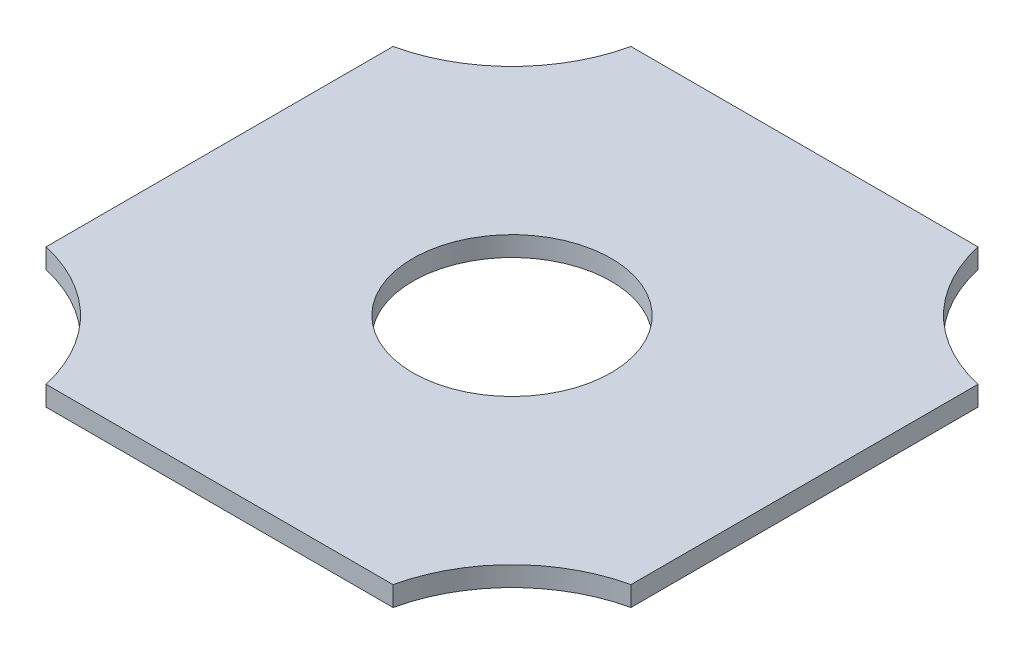
ISO-10303-21;
HEADER;
FILE_DESCRIPTION(('STEP AP214'),'2;1');
FILE_NAME('part.step','',(''),(''),'','','');
FILE_SCHEMA(('AUTOMOTIVE_DESIGN { 1 0 10303 214 1 1 1 1 }'));
ENDSEC;
DATA;
#1=APPLICATION_CONTEXT('core data for automotive mechanical design processes');
#2=APPLICATION_PROTOCOL_DEFINITION('international standard','automotive_design',2000,#1);
#3=PRODUCT_CONTEXT('',#1,'mechanical');
#4=PRODUCT('Part','Part','',(#3));
#5=PRODUCT_RELATED_PRODUCT_CATEGORY('part','',(#4));
#6=PRODUCT_DEFINITION_FORMATION('','',#4);
#7=PRODUCT_DEFINITION_CONTEXT('part definition',#1,'design');
#8=PRODUCT_DEFINITION('design','',#6,#7);
#9=PRODUCT_DEFINITION_SHAPE('','',#8);
#10=(LENGTH_UNIT() NAMED_UNIT(*) SI_UNIT(.MILLI.,.METRE.));
#11=(NAMED_UNIT(*) PLANE_ANGLE_UNIT() SI_UNIT($,.RADIAN.));
#12=(NAMED_UNIT(*) SI_UNIT($,.STERADIAN.) SOLID_ANGLE_UNIT());
#13=UNCERTAINTY_MEASURE_WITH_UNIT(LENGTH_MEASURE(1.E-05),#10,'distance_accuracy_value','');
#14=(GEOMETRIC_REPRESENTATION_CONTEXT(3) GLOBAL_UNCERTAINTY_ASSIGNED_CONTEXT((#13)) GLOBAL_UNIT_ASSIGNED_CONTEXT((#10,
#11,#12)) REPRESENTATION_CONTEXT('',''));
#15=CARTESIAN_POINT('',(0.,0.,0.));
#16=DIRECTION('',(0.,0.,1.));
#17=DIRECTION('',(1.,0.,0.));
#18=AXIS2_PLACEMENT_3D('',#15,#16,#17);
#19=CARTESIAN_POINT('',(-32.2270175622713,2.,-34.0017247818068));
#20=DIRECTION('',(0.,-1.,0.));
#21=DIRECTION('',(0.,0.,-1.));
#22=AXIS2_PLACEMENT_3D('',#19,#20,#21);
#23=CYLINDRICAL_SURFACE('',#22,15.8501875594606);
#24=CARTESIAN_POINT('',(-32.2270175622713,0.,-34.0017247818068));
#25=DIRECTION('',(0.,-1.,0.));
#26=DIRECTION('',(0.,0.,1.));
#27=AXIS2_PLACEMENT_3D('',#24,#25,#26);
#28=CIRCLE('',#27,15.8501875594606);
#29=CARTESIAN_POINT('',(-16.7605386585269,0.,-30.5352458780619));
#30=VERTEX_POINT('',#29);
#31=CARTESIAN_POINT('',(-28.760538658527,0.,-18.5352458780623));
#32=VERTEX_POINT('',#31);
#33=EDGE_CURVE('E137',#30,#32,#28,.T.);
#34=ORIENTED_EDGE('',*,*,#33,.T.);
#35=DIRECTION('',(0.,-1.,0.));
#36=VECTOR('',#35,1.);
#37=CARTESIAN_POINT('',(-28.760538658527,2.,-18.5352458780623));
#38=LINE('',#37,#36);
#39=CARTESIAN_POINT('',(-28.760538658527,2.,-18.5352458780623));
#40=VERTEX_POINT('',#39);
#41=EDGE_CURVE('E11',#40,#32,#38,.T.);
#42=ORIENTED_EDGE('',*,*,#41,.F.);
#43=CARTESIAN_POINT('',(-32.2270175622713,2.,-34.0017247818068));
#44=DIRECTION('',(0.,-1.,0.));
#45=DIRECTION('',(0.,0.,1.));
#46=AXIS2_PLACEMENT_3D('',#43,#44,#45);
#47=CIRCLE('',#46,15.8501875594606);
#48=CARTESIAN_POINT('',(-16.7605386585269,2.,-30.5352458780619));
#49=VERTEX_POINT('',#48);
#50=EDGE_CURVE('E151',#49,#40,#47,.T.);
#51=ORIENTED_EDGE('',*,*,#50,.F.);
#52=DIRECTION('',(0.,-1.,0.));
#53=VECTOR('',#52,1.);
#54=CARTESIAN_POINT('',(-16.7605386585269,2.,-30.5352458780619));
#55=LINE('',#54,#53);
#56=EDGE_CURVE('E133',#49,#30,#55,.T.);
#57=ORIENTED_EDGE('',*,*,#56,.T.);
#58=EDGE_LOOP('',(#34,#42,#51,#57));
#59=FACE_BOUND('',#58,.T.);
#60=ADVANCED_FACE('F40',(#59),#23,.F.);
#61=CARTESIAN_POINT('',(-28.760538658527,2.,-18.5352458780623));
#62=DIRECTION('',(1.,0.,0.));
#63=DIRECTION('',(0.,0.,-1.));
#64=AXIS2_PLACEMENT_3D('',#61,#62,#63);
#65=PLANE('',#64);
#66=DIRECTION('',(0.,0.,1.));
#67=VECTOR('',#66,1.);
#68=CARTESIAN_POINT('',(-28.760538658527,0.,-18.5352458780623));
#69=LINE('',#68,#67);
#70=CARTESIAN_POINT('',(-28.7605386585271,0.,16.4647541219377));
#71=VERTEX_POINT('',#70);
#72=EDGE_CURVE('E140',#32,#71,#69,.T.);
#73=ORIENTED_EDGE('',*,*,#72,.T.);
#74=DIRECTION('',(0.,-1.,0.));
#75=VECTOR('',#74,1.);
#76=CARTESIAN_POINT('',(-28.7605386585271,2.,16.4647541219377));
#77=LINE('',#76,#75);
#78=CARTESIAN_POINT('',(-28.7605386585271,2.,16.4647541219377));
#79=VERTEX_POINT('',#78);
#80=EDGE_CURVE('E49',#79,#71,#77,.T.);
#81=ORIENTED_EDGE('',*,*,#80,.F.);
#82=DIRECTION('',(0.,0.,1.));
#83=VECTOR('',#82,1.);
#84=CARTESIAN_POINT('',(-28.760538658527,2.,-18.5352458780623));
#85=LINE('',#84,#83);
#86=EDGE_CURVE('E100',#40,#79,#85,.T.);
#87=ORIENTED_EDGE('',*,*,#86,.F.);
#88=ORIENTED_EDGE('',*,*,#41,.T.);
#89=EDGE_LOOP('',(#73,#81,#87,#88));
#90=FACE_BOUND('',#89,.T.);
#91=ADVANCED_FACE('F202',(#90),#65,.F.);
#92=CARTESIAN_POINT('',(-32.2270175622719,2.,31.9312330256822));
#93=DIRECTION('',(0.,-1.,0.));
#94=DIRECTION('',(0.,0.,-1.));
#95=AXIS2_PLACEMENT_3D('',#92,#93,#94);
#96=CYLINDRICAL_SURFACE('',#95,15.8501875594607);
#97=CARTESIAN_POINT('',(-32.2270175622719,0.,31.9312330256822));
#98=DIRECTION('',(0.,-1.,0.));
#99=DIRECTION('',(0.,0.,1.));
#100=AXIS2_PLACEMENT_3D('',#97,#98,#99);
#101=CIRCLE('',#100,15.8501875594607);
#102=CARTESIAN_POINT('',(-16.7605386585272,0.,28.464754121938));
#103=VERTEX_POINT('',#102);
#104=EDGE_CURVE('E142',#71,#103,#101,.T.);
#105=ORIENTED_EDGE('',*,*,#104,.T.);
#106=DIRECTION('',(0.,-1.,0.));
#107=VECTOR('',#106,1.);
#108=CARTESIAN_POINT('',(-16.7605386585272,2.,28.464754121938));
#109=LINE('',#108,#107);
#110=CARTESIAN_POINT('',(-16.7605386585272,2.,28.464754121938));
#111=VERTEX_POINT('',#110);
#112=EDGE_CURVE('E158',#111,#103,#109,.T.);
#113=ORIENTED_EDGE('',*,*,#112,.F.);
#114=CARTESIAN_POINT('',(-32.2270175622719,2.,31.9312330256822));
#115=DIRECTION('',(0.,-1.,0.));
#116=DIRECTION('',(0.,0.,1.));
#117=AXIS2_PLACEMENT_3D('',#114,#115,#116);
#118=CIRCLE('',#117,15.8501875594607);
#119=EDGE_CURVE('E167',#79,#111,#118,.T.);
#120=ORIENTED_EDGE('',*,*,#119,.F.);
#121=ORIENTED_EDGE('',*,*,#80,.T.);
#122=EDGE_LOOP('',(#105,#113,#120,#121));
#123=FACE_BOUND('',#122,.T.);
#124=ADVANCED_FACE('F165',(#123),#96,.F.);
#125=CARTESIAN_POINT('',(-16.7605386585272,2.,28.464754121938));
#126=DIRECTION('',(0.,0.,-1.));
#127=DIRECTION('',(-1.,0.,0.));
#128=AXIS2_PLACEMENT_3D('',#125,#126,#127);
#129=PLANE('',#128);
#130=DIRECTION('',(1.,0.,0.));
#131=VECTOR('',#130,1.);
#132=CARTESIAN_POINT('',(-16.7605386585272,0.,28.464754121938));
#133=LINE('',#132,#131);
#134=CARTESIAN_POINT('',(18.2394613414727,0.,28.464754121938));
#135=VERTEX_POINT('',#134);
#136=EDGE_CURVE('E144',#103,#135,#133,.T.);
#137=ORIENTED_EDGE('',*,*,#136,.T.);
#138=DIRECTION('',(0.,-1.,0.));
#139=VECTOR('',#138,1.);
#140=CARTESIAN_POINT('',(18.2394613414727,2.,28.464754121938));
#141=LINE('',#140,#139);
#142=CARTESIAN_POINT('',(18.2394613414727,2.,28.464754121938));
#143=VERTEX_POINT('',#142);
#144=EDGE_CURVE('E155',#143,#135,#141,.T.);
#145=ORIENTED_EDGE('',*,*,#144,.F.);
#146=DIRECTION('',(1.,0.,0.));
#147=VECTOR('',#146,1.);
#148=CARTESIAN_POINT('',(-16.7605386585272,2.,28.464754121938));
#149=LINE('',#148,#147);
#150=EDGE_CURVE('E179',#111,#143,#149,.T.);
#151=ORIENTED_EDGE('',*,*,#150,.F.);
#152=ORIENTED_EDGE('',*,*,#112,.T.);
#153=EDGE_LOOP('',(#137,#145,#151,#152));
#154=FACE_BOUND('',#153,.T.);
#155=ADVANCED_FACE('F175',(#154),#129,.F.);
#156=CARTESIAN_POINT('',(33.7059402452171,2.,31.9312330256826));
#157=DIRECTION('',(0.,-1.,0.));
#158=DIRECTION('',(0.,0.,-1.));
#159=AXIS2_PLACEMENT_3D('',#156,#157,#158);
#160=CYLINDRICAL_SURFACE('',#159,15.8501875594606);
#161=CARTESIAN_POINT('',(33.7059402452171,0.,31.9312330256826));
#162=DIRECTION('',(0.,-1.,0.));
#163=DIRECTION('',(0.,0.,1.));
#164=AXIS2_PLACEMENT_3D('',#161,#162,#163);
#165=CIRCLE('',#164,15.8501875594606);
#166=CARTESIAN_POINT('',(30.2394613414728,0.,16.4647541219381));
#167=VERTEX_POINT('',#166);
#168=EDGE_CURVE('E146',#135,#167,#165,.T.);
#169=ORIENTED_EDGE('',*,*,#168,.T.);
#170=DIRECTION('',(0.,-1.,0.));
#171=VECTOR('',#170,1.);
#172=CARTESIAN_POINT('',(30.2394613414728,2.,16.4647541219381));
#173=LINE('',#172,#171);
#174=CARTESIAN_POINT('',(30.2394613414728,2.,16.4647541219381));
#175=VERTEX_POINT('',#174);
#176=EDGE_CURVE('E128',#175,#167,#173,.T.);
#177=ORIENTED_EDGE('',*,*,#176,.F.);
#178=CARTESIAN_POINT('',(33.7059402452171,2.,31.9312330256826));
#179=DIRECTION('',(0.,-1.,0.));
#180=DIRECTION('',(0.,0.,1.));
#181=AXIS2_PLACEMENT_3D('',#178,#179,#180);
#182=CIRCLE('',#181,15.8501875594606);
#183=EDGE_CURVE('E119',#143,#175,#182,.T.);
#184=ORIENTED_EDGE('',*,*,#183,.F.);
#185=ORIENTED_EDGE('',*,*,#144,.T.);
#186=EDGE_LOOP('',(#169,#177,#184,#185));
#187=FACE_BOUND('',#186,.T.);
#188=ADVANCED_FACE('F178',(#187),#160,.F.);
#189=CARTESIAN_POINT('',(30.2394613414728,2.,16.4647541219381));
#190=DIRECTION('',(-1.,0.,0.));
#191=DIRECTION('',(0.,0.,1.));
#192=AXIS2_PLACEMENT_3D('',#189,#190,#191);
#193=PLANE('',#192);
#194=DIRECTION('',(0.,0.,-1.));
#195=VECTOR('',#194,1.);
#196=CARTESIAN_POINT('',(30.2394613414728,0.,16.4647541219381));
#197=LINE('',#196,#195);
#198=CARTESIAN_POINT('',(30.2394613414728,0.,-18.5352458780619));
#199=VERTEX_POINT('',#198);
#200=EDGE_CURVE('E127',#167,#199,#197,.T.);
#201=ORIENTED_EDGE('',*,*,#200,.T.);
#202=DIRECTION('',(0.,-1.,0.));
#203=VECTOR('',#202,1.);
#204=CARTESIAN_POINT('',(30.2394613414728,2.,-18.5352458780619));
#205=LINE('',#204,#203);
#206=CARTESIAN_POINT('',(30.2394613414728,2.,-18.5352458780619));
#207=VERTEX_POINT('',#206);
#208=EDGE_CURVE('E124',#207,#199,#205,.T.);
#209=ORIENTED_EDGE('',*,*,#208,.F.);
#210=DIRECTION('',(0.,0.,-1.));
#211=VECTOR('',#210,1.);
#212=CARTESIAN_POINT('',(30.2394613414728,2.,16.4647541219381));
#213=LINE('',#212,#211);
#214=EDGE_CURVE('E113',#175,#207,#213,.T.);
#215=ORIENTED_EDGE('',*,*,#214,.F.);
#216=ORIENTED_EDGE('',*,*,#176,.T.);
#217=EDGE_LOOP('',(#201,#209,#215,#216));
#218=FACE_BOUND('',#217,.T.);
#219=ADVANCED_FACE('F125',(#218),#193,.F.);
#220=CARTESIAN_POINT('',(33.7059402452173,2.,-34.0017247818064));
#221=DIRECTION('',(0.,-1.,0.));
#222=DIRECTION('',(0.,0.,-1.));
#223=AXIS2_PLACEMENT_3D('',#220,#221,#222);
#224=CYLINDRICAL_SURFACE('',#223,15.8501875594607);
#225=CARTESIAN_POINT('',(33.7059402452173,0.,-34.0017247818064));
#226=DIRECTION('',(0.,-1.,0.));
#227=DIRECTION('',(0.,0.,1.));
#228=AXIS2_PLACEMENT_3D('',#225,#226,#227);
#229=CIRCLE('',#228,15.8501875594607);
#230=CARTESIAN_POINT('',(18.2394613414727,0.,-30.535245878062));
#231=VERTEX_POINT('',#230);
#232=EDGE_CURVE('E86',#199,#231,#229,.T.);
#233=ORIENTED_EDGE('',*,*,#232,.T.);
#234=DIRECTION('',(0.,-1.,0.));
#235=VECTOR('',#234,1.);
#236=CARTESIAN_POINT('',(18.2394613414727,2.,-30.535245878062));
#237=LINE('',#236,#235);
#238=CARTESIAN_POINT('',(18.2394613414727,2.,-30.535245878062));
#239=VERTEX_POINT('',#238);
#240=EDGE_CURVE('E129',#239,#231,#237,.T.);
#241=ORIENTED_EDGE('',*,*,#240,.F.);
#242=CARTESIAN_POINT('',(33.7059402452173,2.,-34.0017247818064));
#243=DIRECTION('',(0.,-1.,0.));
#244=DIRECTION('',(0.,0.,1.));
#245=AXIS2_PLACEMENT_3D('',#242,#243,#244);
#246=CIRCLE('',#245,15.8501875594607);
#247=EDGE_CURVE('E117',#207,#239,#246,.T.);
#248=ORIENTED_EDGE('',*,*,#247,.F.);
#249=ORIENTED_EDGE('',*,*,#208,.T.);
#250=EDGE_LOOP('',(#233,#241,#248,#249));
#251=FACE_BOUND('',#250,.T.);
#252=ADVANCED_FACE('F131',(#251),#224,.F.);
#253=CARTESIAN_POINT('',(18.2394613414727,2.,-30.535245878062));
#254=DIRECTION('',(0.,0.,1.));
#255=DIRECTION('',(1.,0.,0.));
#256=AXIS2_PLACEMENT_3D('',#253,#254,#255);
#257=PLANE('',#256);
#258=DIRECTION('',(-1.,0.,0.));
#259=VECTOR('',#258,1.);
#260=CARTESIAN_POINT('',(18.2394613414727,0.,-30.535245878062));
#261=LINE('',#260,#259);
#262=EDGE_CURVE('E92',#231,#30,#261,.T.);
#263=ORIENTED_EDGE('',*,*,#262,.T.);
#264=ORIENTED_EDGE('',*,*,#56,.F.);
#265=DIRECTION('',(-1.,0.,0.));
#266=VECTOR('',#265,1.);
#267=CARTESIAN_POINT('',(18.2394613414727,2.,-30.535245878062));
#268=LINE('',#267,#266);
#269=EDGE_CURVE('E57',#239,#49,#268,.T.);
#270=ORIENTED_EDGE('',*,*,#269,.F.);
#271=ORIENTED_EDGE('',*,*,#240,.T.);
#272=EDGE_LOOP('',(#263,#264,#270,#271));
#273=FACE_BOUND('',#272,.T.);
#274=ADVANCED_FACE('F209',(#273),#257,.F.);
#275=CARTESIAN_POINT('',(-32.2270175622713,2.,-34.0017247818068));
#276=DIRECTION('',(0.,1.,0.));
#277=DIRECTION('',(0.,0.,1.));
#278=AXIS2_PLACEMENT_3D('',#275,#276,#277);
#279=PLANE('',#278);
#280=CARTESIAN_POINT('',(0.73946134147285,2.,-1.03524587806197));
#281=DIRECTION('',(0.,1.,0.));
#282=DIRECTION('',(0.,0.,1.));
#283=AXIS2_PLACEMENT_3D('',#280,#281,#282);
#284=CIRCLE('',#283,10.);
#285=CARTESIAN_POINT('',(0.73946134147285,2.,8.96475412193803));
#286=VERTEX_POINT('',#285);
#287=EDGE_CURVE('E185',#286,#286,#284,.T.);
#288=ORIENTED_EDGE('',*,*,#287,.F.);
#289=EDGE_LOOP('',(#288));
#290=FACE_BOUND('',#289,.T.);
#291=ORIENTED_EDGE('',*,*,#50,.T.);
#292=ORIENTED_EDGE('',*,*,#86,.T.);
#293=ORIENTED_EDGE('',*,*,#119,.T.);
#294=ORIENTED_EDGE('',*,*,#150,.T.);
#295=ORIENTED_EDGE('',*,*,#183,.T.);
#296=ORIENTED_EDGE('',*,*,#214,.T.);
#297=ORIENTED_EDGE('',*,*,#247,.T.);
#298=ORIENTED_EDGE('',*,*,#269,.T.);
#299=EDGE_LOOP('',(#291,#292,#293,#294,#295,#296,#297,#298));
#300=FACE_BOUND('',#299,.T.);
#301=ADVANCED_FACE('F115',(#290,#300),#279,.T.);
#302=CARTESIAN_POINT('',(-32.2270175622713,0.,-34.0017247818068));
#303=DIRECTION('',(0.,1.,0.));
#304=DIRECTION('',(0.,0.,1.));
#305=AXIS2_PLACEMENT_3D('',#302,#303,#304);
#306=PLANE('',#305);
#307=CARTESIAN_POINT('',(0.73946134147285,0.,-1.03524587806197));
#308=DIRECTION('',(0.,1.,0.));
#309=DIRECTION('',(0.,0.,1.));
#310=AXIS2_PLACEMENT_3D('',#307,#308,#309);
#311=CIRCLE('',#310,10.);
#312=CARTESIAN_POINT('',(0.73946134147285,0.,8.96475412193803));
#313=VERTEX_POINT('',#312);
#314=EDGE_CURVE('E43',#313,#313,#311,.T.);
#315=ORIENTED_EDGE('',*,*,#314,.T.);
#316=EDGE_LOOP('',(#315));
#317=FACE_BOUND('',#316,.T.);
#318=ORIENTED_EDGE('',*,*,#33,.F.);
#319=ORIENTED_EDGE('',*,*,#262,.F.);
#320=ORIENTED_EDGE('',*,*,#232,.F.);
#321=ORIENTED_EDGE('',*,*,#200,.F.);
#322=ORIENTED_EDGE('',*,*,#168,.F.);
#323=ORIENTED_EDGE('',*,*,#136,.F.);
#324=ORIENTED_EDGE('',*,*,#104,.F.);
#325=ORIENTED_EDGE('',*,*,#72,.F.);
#326=EDGE_LOOP('',(#318,#319,#320,#321,#322,#323,#324,#325));
#327=FACE_BOUND('',#326,.T.);
#328=ADVANCED_FACE('F171',(#317,#327),#306,.F.);
#329=CARTESIAN_POINT('',(0.73946134147285,-1.,-1.03524587806197));
#330=DIRECTION('',(0.,1.,0.));
#331=DIRECTION('',(0.,0.,1.));
#332=AXIS2_PLACEMENT_3D('',#329,#330,#331);
#333=CYLINDRICAL_SURFACE('',#332,10.);
#334=ORIENTED_EDGE('',*,*,#287,.T.);
#335=EDGE_LOOP('',(#334));
#336=FACE_BOUND('',#335,.T.);
#337=ORIENTED_EDGE('',*,*,#314,.F.);
#338=EDGE_LOOP('',(#337));
#339=FACE_BOUND('',#338,.T.);
#340=ADVANCED_FACE('F193',(#336,#339),#333,.F.);
#341=CLOSED_SHELL('',(#60,#91,#124,#155,#188,#219,#252,#274,#301,#328,#340));
#342=MANIFOLD_SOLID_BREP('B2',#341);
#343=ADVANCED_BREP_SHAPE_REPRESENTATION('',(#18,#342),#14);
#344=SHAPE_DEFINITION_REPRESENTATION(#9,#343);
ENDSEC;
END-ISO-10303-21;
